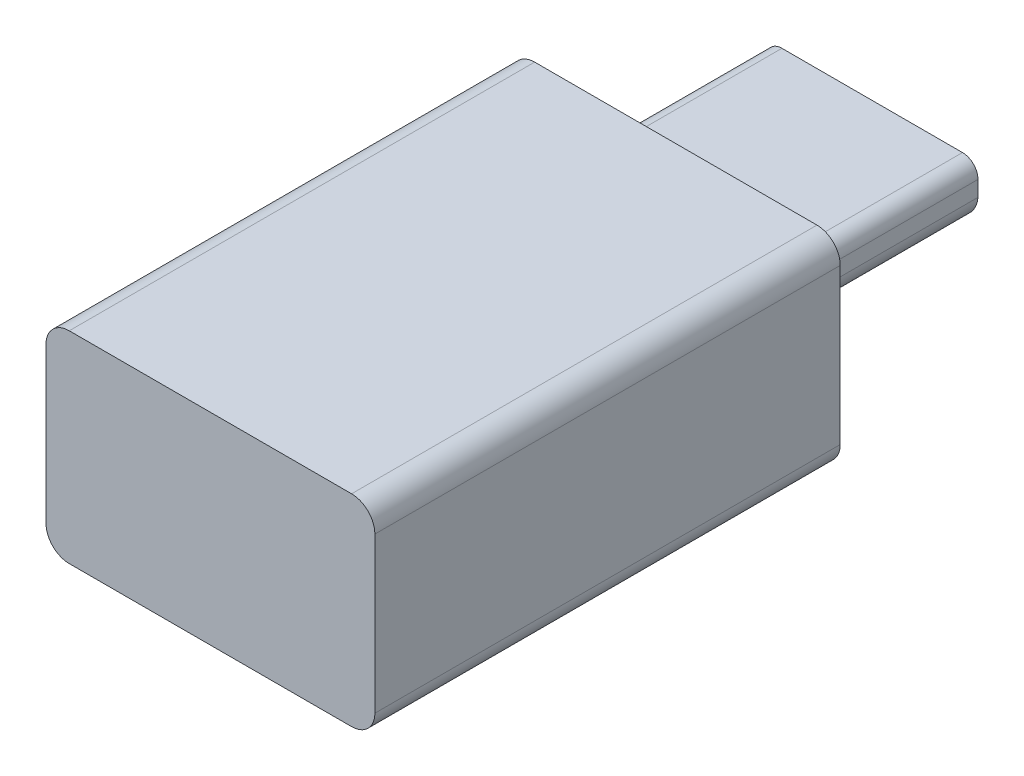
ISO-10303-21;
HEADER;
FILE_DESCRIPTION(('STEP AP214'),'2;1');
FILE_NAME('part.step','',(''),(''),'','','');
FILE_SCHEMA(('AUTOMOTIVE_DESIGN { 1 0 10303 214 1 1 1 1 }'));
ENDSEC;
DATA;
#1=APPLICATION_CONTEXT('core data for automotive mechanical design processes');
#2=APPLICATION_PROTOCOL_DEFINITION('international standard','automotive_design',2000,#1);
#3=PRODUCT_CONTEXT('',#1,'mechanical');
#4=PRODUCT('Part','Part','',(#3));
#5=PRODUCT_RELATED_PRODUCT_CATEGORY('part','',(#4));
#6=PRODUCT_DEFINITION_FORMATION('','',#4);
#7=PRODUCT_DEFINITION_CONTEXT('part definition',#1,'design');
#8=PRODUCT_DEFINITION('design','',#6,#7);
#9=PRODUCT_DEFINITION_SHAPE('','',#8);
#10=(LENGTH_UNIT() NAMED_UNIT(*) SI_UNIT(.MILLI.,.METRE.));
#11=(NAMED_UNIT(*) PLANE_ANGLE_UNIT() SI_UNIT($,.RADIAN.));
#12=(NAMED_UNIT(*) SI_UNIT($,.STERADIAN.) SOLID_ANGLE_UNIT());
#13=UNCERTAINTY_MEASURE_WITH_UNIT(LENGTH_MEASURE(1.E-05),#10,'distance_accuracy_value','');
#14=(GEOMETRIC_REPRESENTATION_CONTEXT(3) GLOBAL_UNCERTAINTY_ASSIGNED_CONTEXT((#13)) GLOBAL_UNIT_ASSIGNED_CONTEXT((#10,
#11,#12)) REPRESENTATION_CONTEXT('',''));
#15=CARTESIAN_POINT('',(0.,0.,0.));
#16=DIRECTION('',(0.,0.,1.));
#17=DIRECTION('',(1.,0.,0.));
#18=AXIS2_PLACEMENT_3D('',#15,#16,#17);
#19=CARTESIAN_POINT('',(-38.2706605434778,31.0905654389587,72.6019122643422));
#20=DIRECTION('',(0.,0.,1.));
#21=DIRECTION('',(1.,0.,0.));
#22=AXIS2_PLACEMENT_3D('',#19,#20,#21);
#23=CYLINDRICAL_SURFACE('',#22,0.750000000000001);
#24=CARTESIAN_POINT('',(-38.2706605434778,31.0905654389587,87.6019122643422));
#25=DIRECTION('',(0.,0.,-1.));
#26=DIRECTION('',(-1.,0.,0.));
#27=AXIS2_PLACEMENT_3D('',#24,#25,#26);
#28=CIRCLE('',#27,0.750000000000001);
#29=CARTESIAN_POINT('',(-37.5206605434778,31.0905654389587,87.6019122643422));
#30=VERTEX_POINT('',#29);
#31=CARTESIAN_POINT('',(-38.2706605434778,30.3405654389587,87.6019122643422));
#32=VERTEX_POINT('',#31);
#33=EDGE_CURVE('E142',#30,#32,#28,.T.);
#34=ORIENTED_EDGE('',*,*,#33,.T.);
#35=DIRECTION('',(0.,0.,1.));
#36=VECTOR('',#35,1.);
#37=CARTESIAN_POINT('',(-38.2706605434778,30.3405654389587,72.6019122643422));
#38=LINE('',#37,#36);
#39=CARTESIAN_POINT('',(-38.2706605434778,30.3405654389587,72.6019122643422));
#40=VERTEX_POINT('',#39);
#41=EDGE_CURVE('E11',#40,#32,#38,.T.);
#42=ORIENTED_EDGE('',*,*,#41,.F.);
#43=CARTESIAN_POINT('',(-38.2706605434778,31.0905654389587,72.6019122643422));
#44=DIRECTION('',(0.,0.,-1.));
#45=DIRECTION('',(-1.,0.,0.));
#46=AXIS2_PLACEMENT_3D('',#43,#44,#45);
#47=CIRCLE('',#46,0.750000000000001);
#48=CARTESIAN_POINT('',(-37.5206605434778,31.0905654389587,72.6019122643422));
#49=VERTEX_POINT('',#48);
#50=EDGE_CURVE('E158',#49,#40,#47,.T.);
#51=ORIENTED_EDGE('',*,*,#50,.F.);
#52=DIRECTION('',(0.,0.,1.));
#53=VECTOR('',#52,1.);
#54=CARTESIAN_POINT('',(-37.5206605434778,31.0905654389587,72.6019122643422));
#55=LINE('',#54,#53);
#56=EDGE_CURVE('E138',#49,#30,#55,.T.);
#57=ORIENTED_EDGE('',*,*,#56,.T.);
#58=EDGE_LOOP('',(#34,#42,#51,#57));
#59=FACE_BOUND('',#58,.T.);
#60=ADVANCED_FACE('F34',(#59),#23,.T.);
#61=CARTESIAN_POINT('',(-38.2706605434778,30.3405654389587,72.6019122643422));
#62=DIRECTION('',(0.,1.,0.));
#63=DIRECTION('',(0.,0.,1.));
#64=AXIS2_PLACEMENT_3D('',#61,#62,#63);
#65=PLANE('',#64);
#66=DIRECTION('',(-1.,0.,0.));
#67=VECTOR('',#66,1.);
#68=CARTESIAN_POINT('',(-38.2706605434778,30.3405654389587,87.6019122643422));
#69=LINE('',#68,#67);
#70=CARTESIAN_POINT('',(-47.3706605434778,30.3405654389587,87.6019122643422));
#71=VERTEX_POINT('',#70);
#72=EDGE_CURVE('E145',#32,#71,#69,.T.);
#73=ORIENTED_EDGE('',*,*,#72,.T.);
#74=DIRECTION('',(0.,0.,1.));
#75=VECTOR('',#74,1.);
#76=CARTESIAN_POINT('',(-47.3706605434778,30.3405654389587,72.6019122643422));
#77=LINE('',#76,#75);
#78=CARTESIAN_POINT('',(-47.3706605434778,30.3405654389587,72.6019122643422));
#79=VERTEX_POINT('',#78);
#80=EDGE_CURVE('E41',#79,#71,#77,.T.);
#81=ORIENTED_EDGE('',*,*,#80,.F.);
#82=DIRECTION('',(-1.,0.,0.));
#83=VECTOR('',#82,1.);
#84=CARTESIAN_POINT('',(-38.2706605434778,30.3405654389587,72.6019122643422));
#85=LINE('',#84,#83);
#86=EDGE_CURVE('E98',#40,#79,#85,.T.);
#87=ORIENTED_EDGE('',*,*,#86,.F.);
#88=ORIENTED_EDGE('',*,*,#41,.T.);
#89=EDGE_LOOP('',(#73,#81,#87,#88));
#90=FACE_BOUND('',#89,.T.);
#91=ADVANCED_FACE('F318',(#90),#65,.F.);
#92=CARTESIAN_POINT('',(-47.3706605434778,31.0905654389587,72.6019122643422));
#93=DIRECTION('',(0.,0.,1.));
#94=DIRECTION('',(1.,0.,0.));
#95=AXIS2_PLACEMENT_3D('',#92,#93,#94);
#96=CYLINDRICAL_SURFACE('',#95,0.750000000000001);
#97=CARTESIAN_POINT('',(-47.3706605434778,31.0905654389587,87.6019122643422));
#98=DIRECTION('',(0.,0.,-1.));
#99=DIRECTION('',(-1.,0.,0.));
#100=AXIS2_PLACEMENT_3D('',#97,#98,#99);
#101=CIRCLE('',#100,0.750000000000001);
#102=CARTESIAN_POINT('',(-48.1206605434778,31.0905654389587,87.6019122643422));
#103=VERTEX_POINT('',#102);
#104=EDGE_CURVE('E148',#71,#103,#101,.T.);
#105=ORIENTED_EDGE('',*,*,#104,.T.);
#106=DIRECTION('',(0.,0.,1.));
#107=VECTOR('',#106,1.);
#108=CARTESIAN_POINT('',(-48.1206605434778,31.0905654389587,72.6019122643422));
#109=LINE('',#108,#107);
#110=CARTESIAN_POINT('',(-48.1206605434778,31.0905654389587,72.6019122643422));
#111=VERTEX_POINT('',#110);
#112=EDGE_CURVE('E165',#111,#103,#109,.T.);
#113=ORIENTED_EDGE('',*,*,#112,.F.);
#114=CARTESIAN_POINT('',(-47.3706605434778,31.0905654389587,72.6019122643422));
#115=DIRECTION('',(0.,0.,-1.));
#116=DIRECTION('',(-1.,0.,0.));
#117=AXIS2_PLACEMENT_3D('',#114,#115,#116);
#118=CIRCLE('',#117,0.750000000000001);
#119=EDGE_CURVE('E173',#79,#111,#118,.T.);
#120=ORIENTED_EDGE('',*,*,#119,.F.);
#121=ORIENTED_EDGE('',*,*,#80,.T.);
#122=EDGE_LOOP('',(#105,#113,#120,#121));
#123=FACE_BOUND('',#122,.T.);
#124=ADVANCED_FACE('F171',(#123),#96,.T.);
#125=CARTESIAN_POINT('',(-48.1206605434778,36.0905654389587,72.6019122643422));
#126=DIRECTION('',(1.,0.,0.));
#127=DIRECTION('',(0.,0.,-1.));
#128=AXIS2_PLACEMENT_3D('',#125,#126,#127);
#129=PLANE('',#128);
#130=DIRECTION('',(0.,1.,0.));
#131=VECTOR('',#130,1.);
#132=CARTESIAN_POINT('',(-48.1206605434778,36.0905654389587,87.6019122643422));
#133=LINE('',#132,#131);
#134=CARTESIAN_POINT('',(-48.1206605434778,36.0905654389587,87.6019122643422));
#135=VERTEX_POINT('',#134);
#136=EDGE_CURVE('E150',#103,#135,#133,.T.);
#137=ORIENTED_EDGE('',*,*,#136,.T.);
#138=DIRECTION('',(0.,0.,1.));
#139=VECTOR('',#138,1.);
#140=CARTESIAN_POINT('',(-48.1206605434778,36.0905654389587,72.6019122643422));
#141=LINE('',#140,#139);
#142=CARTESIAN_POINT('',(-48.1206605434778,36.0905654389587,72.6019122643422));
#143=VERTEX_POINT('',#142);
#144=EDGE_CURVE('E162',#143,#135,#141,.T.);
#145=ORIENTED_EDGE('',*,*,#144,.F.);
#146=DIRECTION('',(0.,1.,0.));
#147=VECTOR('',#146,1.);
#148=CARTESIAN_POINT('',(-48.1206605434778,36.0905654389587,72.6019122643422));
#149=LINE('',#148,#147);
#150=EDGE_CURVE('E185',#111,#143,#149,.T.);
#151=ORIENTED_EDGE('',*,*,#150,.F.);
#152=ORIENTED_EDGE('',*,*,#112,.T.);
#153=EDGE_LOOP('',(#137,#145,#151,#152));
#154=FACE_BOUND('',#153,.T.);
#155=ADVANCED_FACE('F181',(#154),#129,.F.);
#156=CARTESIAN_POINT('',(-47.3706605434778,36.0905654389587,72.6019122643422));
#157=DIRECTION('',(0.,0.,1.));
#158=DIRECTION('',(1.,0.,0.));
#159=AXIS2_PLACEMENT_3D('',#156,#157,#158);
#160=CYLINDRICAL_SURFACE('',#159,0.750000000000001);
#161=CARTESIAN_POINT('',(-47.3706605434778,36.0905654389587,87.6019122643422));
#162=DIRECTION('',(0.,0.,-1.));
#163=DIRECTION('',(1.,0.,0.));
#164=AXIS2_PLACEMENT_3D('',#161,#162,#163);
#165=CIRCLE('',#164,0.750000000000001);
#166=CARTESIAN_POINT('',(-47.3706605434778,36.8405654389587,87.6019122643422));
#167=VERTEX_POINT('',#166);
#168=EDGE_CURVE('E152',#135,#167,#165,.T.);
#169=ORIENTED_EDGE('',*,*,#168,.T.);
#170=DIRECTION('',(0.,0.,1.));
#171=VECTOR('',#170,1.);
#172=CARTESIAN_POINT('',(-47.3706605434778,36.8405654389587,72.6019122643422));
#173=LINE('',#172,#171);
#174=CARTESIAN_POINT('',(-47.3706605434778,36.8405654389587,72.6019122643422));
#175=VERTEX_POINT('',#174);
#176=EDGE_CURVE('E133',#175,#167,#173,.T.);
#177=ORIENTED_EDGE('',*,*,#176,.F.);
#178=CARTESIAN_POINT('',(-47.3706605434778,36.0905654389587,72.6019122643422));
#179=DIRECTION('',(0.,0.,-1.));
#180=DIRECTION('',(1.,0.,0.));
#181=AXIS2_PLACEMENT_3D('',#178,#179,#180);
#182=CIRCLE('',#181,0.750000000000001);
#183=EDGE_CURVE('E121',#143,#175,#182,.T.);
#184=ORIENTED_EDGE('',*,*,#183,.F.);
#185=ORIENTED_EDGE('',*,*,#144,.T.);
#186=EDGE_LOOP('',(#169,#177,#184,#185));
#187=FACE_BOUND('',#186,.T.);
#188=ADVANCED_FACE('F184',(#187),#160,.T.);
#189=CARTESIAN_POINT('',(-38.2706605434778,36.8405654389587,72.6019122643422));
#190=DIRECTION('',(0.,-1.,0.));
#191=DIRECTION('',(0.,0.,-1.));
#192=AXIS2_PLACEMENT_3D('',#189,#190,#191);
#193=PLANE('',#192);
#194=DIRECTION('',(1.,0.,0.));
#195=VECTOR('',#194,1.);
#196=CARTESIAN_POINT('',(-38.2706605434778,36.8405654389587,87.6019122643422));
#197=LINE('',#196,#195);
#198=CARTESIAN_POINT('',(-38.2706605434778,36.8405654389587,87.6019122643422));
#199=VERTEX_POINT('',#198);
#200=EDGE_CURVE('E130',#167,#199,#197,.T.);
#201=ORIENTED_EDGE('',*,*,#200,.T.);
#202=DIRECTION('',(0.,0.,1.));
#203=VECTOR('',#202,1.);
#204=CARTESIAN_POINT('',(-38.2706605434778,36.8405654389587,72.6019122643422));
#205=LINE('',#204,#203);
#206=CARTESIAN_POINT('',(-38.2706605434778,36.8405654389587,72.6019122643422));
#207=VERTEX_POINT('',#206);
#208=EDGE_CURVE('E127',#207,#199,#205,.T.);
#209=ORIENTED_EDGE('',*,*,#208,.F.);
#210=DIRECTION('',(1.,0.,0.));
#211=VECTOR('',#210,1.);
#212=CARTESIAN_POINT('',(-38.2706605434778,36.8405654389587,72.6019122643422));
#213=LINE('',#212,#211);
#214=EDGE_CURVE('E114',#175,#207,#213,.T.);
#215=ORIENTED_EDGE('',*,*,#214,.F.);
#216=ORIENTED_EDGE('',*,*,#176,.T.);
#217=EDGE_LOOP('',(#201,#209,#215,#216));
#218=FACE_BOUND('',#217,.T.);
#219=ADVANCED_FACE('F128',(#218),#193,.F.);
#220=CARTESIAN_POINT('',(-38.2706605434778,36.0905654389587,72.6019122643422));
#221=DIRECTION('',(0.,0.,1.));
#222=DIRECTION('',(1.,0.,0.));
#223=AXIS2_PLACEMENT_3D('',#220,#221,#222);
#224=CYLINDRICAL_SURFACE('',#223,0.750000000000001);
#225=CARTESIAN_POINT('',(-38.2706605434778,36.0905654389587,87.6019122643422));
#226=DIRECTION('',(0.,0.,-1.));
#227=DIRECTION('',(-1.,0.,0.));
#228=AXIS2_PLACEMENT_3D('',#225,#226,#227);
#229=CIRCLE('',#228,0.750000000000001);
#230=CARTESIAN_POINT('',(-37.5206605434778,36.0905654389587,87.6019122643422));
#231=VERTEX_POINT('',#230);
#232=EDGE_CURVE('E155',#199,#231,#229,.T.);
#233=ORIENTED_EDGE('',*,*,#232,.T.);
#234=DIRECTION('',(0.,0.,1.));
#235=VECTOR('',#234,1.);
#236=CARTESIAN_POINT('',(-37.5206605434778,36.0905654389587,72.6019122643422));
#237=LINE('',#236,#235);
#238=CARTESIAN_POINT('',(-37.5206605434778,36.0905654389587,72.6019122643422));
#239=VERTEX_POINT('',#238);
#240=EDGE_CURVE('E134',#239,#231,#237,.T.);
#241=ORIENTED_EDGE('',*,*,#240,.F.);
#242=CARTESIAN_POINT('',(-38.2706605434778,36.0905654389587,72.6019122643422));
#243=DIRECTION('',(0.,0.,-1.));
#244=DIRECTION('',(-1.,0.,0.));
#245=AXIS2_PLACEMENT_3D('',#242,#243,#244);
#246=CIRCLE('',#245,0.750000000000001);
#247=EDGE_CURVE('E118',#207,#239,#246,.T.);
#248=ORIENTED_EDGE('',*,*,#247,.F.);
#249=ORIENTED_EDGE('',*,*,#208,.T.);
#250=EDGE_LOOP('',(#233,#241,#248,#249));
#251=FACE_BOUND('',#250,.T.);
#252=ADVANCED_FACE('F136',(#251),#224,.T.);
#253=CARTESIAN_POINT('',(-37.5206605434778,36.0905654389587,72.6019122643422));
#254=DIRECTION('',(-1.,0.,0.));
#255=DIRECTION('',(0.,0.,1.));
#256=AXIS2_PLACEMENT_3D('',#253,#254,#255);
#257=PLANE('',#256);
#258=DIRECTION('',(0.,-1.,0.));
#259=VECTOR('',#258,1.);
#260=CARTESIAN_POINT('',(-37.5206605434778,36.0905654389587,87.6019122643422));
#261=LINE('',#260,#259);
#262=EDGE_CURVE('E90',#231,#30,#261,.T.);
#263=ORIENTED_EDGE('',*,*,#262,.T.);
#264=ORIENTED_EDGE('',*,*,#56,.F.);
#265=DIRECTION('',(0.,-1.,0.));
#266=VECTOR('',#265,1.);
#267=CARTESIAN_POINT('',(-37.5206605434778,36.0905654389587,72.6019122643422));
#268=LINE('',#267,#266);
#269=EDGE_CURVE('E57',#239,#49,#268,.T.);
#270=ORIENTED_EDGE('',*,*,#269,.F.);
#271=ORIENTED_EDGE('',*,*,#240,.T.);
#272=EDGE_LOOP('',(#263,#264,#270,#271));
#273=FACE_BOUND('',#272,.T.);
#274=ADVANCED_FACE('F325',(#273),#257,.F.);
#275=CARTESIAN_POINT('',(-38.2706605434778,31.0905654389587,72.6019122643422));
#276=DIRECTION('',(0.,0.,-1.));
#277=DIRECTION('',(-1.,0.,0.));
#278=AXIS2_PLACEMENT_3D('',#275,#276,#277);
#279=PLANE('',#278);
#280=CARTESIAN_POINT('',(-40.3206605434778,33.9644208606455,72.6019122643422));
#281=DIRECTION('',(0.,0.,-1.));
#282=DIRECTION('',(-1.,0.,0.));
#283=AXIS2_PLACEMENT_3D('',#280,#281,#282);
#284=CIRCLE('',#283,0.91385542168674);
#285=CARTESIAN_POINT('',(-40.3206605434778,33.0505654389587,72.6019122643422));
#286=VERTEX_POINT('',#285);
#287=CARTESIAN_POINT('',(-39.4106605434778,33.8805654389587,72.6019122643422));
#288=VERTEX_POINT('',#287);
#289=EDGE_CURVE('E233',#286,#288,#284,.F.);
#290=ORIENTED_EDGE('',*,*,#289,.T.);
#291=DIRECTION('',(0.,-1.,0.));
#292=VECTOR('',#291,1.);
#293=CARTESIAN_POINT('',(-39.4106605434778,0.,72.6019122643422));
#294=LINE('',#293,#292);
#295=CARTESIAN_POINT('',(-39.4106605434778,34.3805654389587,72.6019122643422));
#296=VERTEX_POINT('',#295);
#297=EDGE_CURVE('E213',#296,#288,#294,.T.);
#298=ORIENTED_EDGE('',*,*,#297,.F.);
#299=CARTESIAN_POINT('',(-39.9106605434778,34.3805654389587,72.6019122643422));
#300=DIRECTION('',(0.,0.,-1.));
#301=DIRECTION('',(-1.,0.,0.));
#302=AXIS2_PLACEMENT_3D('',#299,#300,#301);
#303=CIRCLE('',#302,0.5);
#304=CARTESIAN_POINT('',(-39.9106605434778,34.8805654389587,72.6019122643422));
#305=VERTEX_POINT('',#304);
#306=EDGE_CURVE('E216',#305,#296,#303,.T.);
#307=ORIENTED_EDGE('',*,*,#306,.F.);
#308=DIRECTION('',(-1.,0.,0.));
#309=VECTOR('',#308,1.);
#310=CARTESIAN_POINT('',(0.,34.8805654389587,72.6019122643422));
#311=LINE('',#310,#309);
#312=CARTESIAN_POINT('',(-45.7306605434778,34.8805654389587,72.6019122643422));
#313=VERTEX_POINT('',#312);
#314=EDGE_CURVE('E218',#305,#313,#311,.T.);
#315=ORIENTED_EDGE('',*,*,#314,.T.);
#316=CARTESIAN_POINT('',(-45.7306605434778,34.3805654389587,72.6019122643422));
#317=DIRECTION('',(0.,0.,-1.));
#318=DIRECTION('',(-1.,0.,0.));
#319=AXIS2_PLACEMENT_3D('',#316,#317,#318);
#320=CIRCLE('',#319,0.5);
#321=CARTESIAN_POINT('',(-46.2306605434778,34.3805654389587,72.6019122643422));
#322=VERTEX_POINT('',#321);
#323=EDGE_CURVE('E221',#313,#322,#320,.F.);
#324=ORIENTED_EDGE('',*,*,#323,.T.);
#325=DIRECTION('',(0.,-1.,0.));
#326=VECTOR('',#325,1.);
#327=CARTESIAN_POINT('',(-46.2306605434778,0.,72.6019122643422));
#328=LINE('',#327,#326);
#329=CARTESIAN_POINT('',(-46.2306605434778,33.8805654389587,72.6019122643422));
#330=VERTEX_POINT('',#329);
#331=EDGE_CURVE('E224',#322,#330,#328,.T.);
#332=ORIENTED_EDGE('',*,*,#331,.T.);
#333=CARTESIAN_POINT('',(-45.3206605434778,33.9644208606455,72.6019122643422));
#334=DIRECTION('',(0.,0.,-1.));
#335=DIRECTION('',(-1.,0.,0.));
#336=AXIS2_PLACEMENT_3D('',#333,#334,#335);
#337=CIRCLE('',#336,0.91385542168674);
#338=CARTESIAN_POINT('',(-45.3206605434778,33.0505654389587,72.6019122643422));
#339=VERTEX_POINT('',#338);
#340=EDGE_CURVE('E227',#339,#330,#337,.T.);
#341=ORIENTED_EDGE('',*,*,#340,.F.);
#342=DIRECTION('',(-1.,0.,0.));
#343=VECTOR('',#342,1.);
#344=CARTESIAN_POINT('',(0.,33.0505654389587,72.6019122643422));
#345=LINE('',#344,#343);
#346=EDGE_CURVE('E230',#286,#339,#345,.T.);
#347=ORIENTED_EDGE('',*,*,#346,.F.);
#348=EDGE_LOOP('',(#290,#298,#307,#315,#324,#332,#341,#347));
#349=FACE_BOUND('',#348,.T.);
#350=ORIENTED_EDGE('',*,*,#50,.T.);
#351=ORIENTED_EDGE('',*,*,#86,.T.);
#352=ORIENTED_EDGE('',*,*,#119,.T.);
#353=ORIENTED_EDGE('',*,*,#150,.T.);
#354=ORIENTED_EDGE('',*,*,#183,.T.);
#355=ORIENTED_EDGE('',*,*,#214,.T.);
#356=ORIENTED_EDGE('',*,*,#247,.T.);
#357=ORIENTED_EDGE('',*,*,#269,.T.);
#358=EDGE_LOOP('',(#350,#351,#352,#353,#354,#355,#356,#357));
#359=FACE_BOUND('',#358,.T.);
#360=ADVANCED_FACE('F116',(#349,#359),#279,.T.);
#361=CARTESIAN_POINT('',(-38.2706605434778,31.0905654389587,87.6019122643422));
#362=DIRECTION('',(0.,0.,-1.));
#363=DIRECTION('',(-1.,0.,0.));
#364=AXIS2_PLACEMENT_3D('',#361,#362,#363);
#365=PLANE('',#364);
#366=ORIENTED_EDGE('',*,*,#33,.F.);
#367=ORIENTED_EDGE('',*,*,#262,.F.);
#368=ORIENTED_EDGE('',*,*,#232,.F.);
#369=ORIENTED_EDGE('',*,*,#200,.F.);
#370=ORIENTED_EDGE('',*,*,#168,.F.);
#371=ORIENTED_EDGE('',*,*,#136,.F.);
#372=ORIENTED_EDGE('',*,*,#104,.F.);
#373=ORIENTED_EDGE('',*,*,#72,.F.);
#374=EDGE_LOOP('',(#366,#367,#368,#369,#370,#371,#372,#373));
#375=FACE_BOUND('',#374,.T.);
#376=ADVANCED_FACE('F177',(#375),#365,.F.);
#377=CARTESIAN_POINT('',(-40.3206605434778,33.9644208606455,66.2719122643422));
#378=DIRECTION('',(0.,0.,1.));
#379=DIRECTION('',(1.,0.,0.));
#380=AXIS2_PLACEMENT_3D('',#377,#378,#379);
#381=CYLINDRICAL_SURFACE('',#380,0.91385542168674);
#382=ORIENTED_EDGE('',*,*,#289,.F.);
#383=DIRECTION('',(0.,0.,1.));
#384=VECTOR('',#383,1.);
#385=CARTESIAN_POINT('',(-40.3206605434778,33.0505654389587,66.2719122643422));
#386=LINE('',#385,#384);
#387=CARTESIAN_POINT('',(-40.3206605434778,33.0505654389587,66.2719122643422));
#388=VERTEX_POINT('',#387);
#389=EDGE_CURVE('E146',#388,#286,#386,.T.);
#390=ORIENTED_EDGE('',*,*,#389,.F.);
#391=CARTESIAN_POINT('',(-40.3206605434778,33.9644208606455,66.2719122643422));
#392=DIRECTION('',(0.,0.,-1.));
#393=DIRECTION('',(-1.,0.,0.));
#394=AXIS2_PLACEMENT_3D('',#391,#392,#393);
#395=CIRCLE('',#394,0.91385542168674);
#396=CARTESIAN_POINT('',(-39.4106605434778,33.8805654389587,66.2719122643422));
#397=VERTEX_POINT('',#396);
#398=EDGE_CURVE('E215',#388,#397,#395,.F.);
#399=ORIENTED_EDGE('',*,*,#398,.T.);
#400=DIRECTION('',(0.,0.,1.));
#401=VECTOR('',#400,1.);
#402=CARTESIAN_POINT('',(-39.4106605434778,33.8805654389587,66.2719122643422));
#403=LINE('',#402,#401);
#404=EDGE_CURVE('E209',#397,#288,#403,.T.);
#405=ORIENTED_EDGE('',*,*,#404,.T.);
#406=EDGE_LOOP('',(#382,#390,#399,#405));
#407=FACE_BOUND('',#406,.T.);
#408=ADVANCED_FACE('F261',(#407),#381,.T.);
#409=CARTESIAN_POINT('',(0.,33.0505654389587,66.2719122643422));
#410=DIRECTION('',(0.,1.,0.));
#411=DIRECTION('',(0.,0.,1.));
#412=AXIS2_PLACEMENT_3D('',#409,#410,#411);
#413=PLANE('',#412);
#414=ORIENTED_EDGE('',*,*,#346,.T.);
#415=DIRECTION('',(0.,0.,1.));
#416=VECTOR('',#415,1.);
#417=CARTESIAN_POINT('',(-45.3206605434778,33.0505654389587,66.2719122643422));
#418=LINE('',#417,#416);
#419=CARTESIAN_POINT('',(-45.3206605434778,33.0505654389587,66.2719122643422));
#420=VERTEX_POINT('',#419);
#421=EDGE_CURVE('E193',#420,#339,#418,.T.);
#422=ORIENTED_EDGE('',*,*,#421,.F.);
#423=DIRECTION('',(-1.,0.,0.));
#424=VECTOR('',#423,1.);
#425=CARTESIAN_POINT('',(0.,33.0505654389587,66.2719122643422));
#426=LINE('',#425,#424);
#427=EDGE_CURVE('E253',#388,#420,#426,.T.);
#428=ORIENTED_EDGE('',*,*,#427,.F.);
#429=ORIENTED_EDGE('',*,*,#389,.T.);
#430=EDGE_LOOP('',(#414,#422,#428,#429));
#431=FACE_BOUND('',#430,.T.);
#432=ADVANCED_FACE('F389',(#431),#413,.F.);
#433=CARTESIAN_POINT('',(-45.3206605434778,33.9644208606455,66.2719122643422));
#434=DIRECTION('',(0.,0.,1.));
#435=DIRECTION('',(1.,0.,0.));
#436=AXIS2_PLACEMENT_3D('',#433,#434,#435);
#437=CYLINDRICAL_SURFACE('',#436,0.91385542168674);
#438=ORIENTED_EDGE('',*,*,#340,.T.);
#439=DIRECTION('',(0.,0.,1.));
#440=VECTOR('',#439,1.);
#441=CARTESIAN_POINT('',(-46.2306605434778,33.8805654389587,66.2719122643422));
#442=LINE('',#441,#440);
#443=CARTESIAN_POINT('',(-46.2306605434778,33.8805654389587,66.2719122643422));
#444=VERTEX_POINT('',#443);
#445=EDGE_CURVE('E196',#444,#330,#442,.T.);
#446=ORIENTED_EDGE('',*,*,#445,.F.);
#447=CARTESIAN_POINT('',(-45.3206605434778,33.9644208606455,66.2719122643422));
#448=DIRECTION('',(0.,0.,-1.));
#449=DIRECTION('',(-1.,0.,0.));
#450=AXIS2_PLACEMENT_3D('',#447,#448,#449);
#451=CIRCLE('',#450,0.91385542168674);
#452=EDGE_CURVE('E250',#420,#444,#451,.T.);
#453=ORIENTED_EDGE('',*,*,#452,.F.);
#454=ORIENTED_EDGE('',*,*,#421,.T.);
#455=EDGE_LOOP('',(#438,#446,#453,#454));
#456=FACE_BOUND('',#455,.T.);
#457=ADVANCED_FACE('F399',(#456),#437,.T.);
#458=CARTESIAN_POINT('',(-46.2306605434778,0.,66.2719122643422));
#459=DIRECTION('',(-1.,0.,0.));
#460=DIRECTION('',(0.,0.,1.));
#461=AXIS2_PLACEMENT_3D('',#458,#459,#460);
#462=PLANE('',#461);
#463=ORIENTED_EDGE('',*,*,#331,.F.);
#464=DIRECTION('',(0.,0.,1.));
#465=VECTOR('',#464,1.);
#466=CARTESIAN_POINT('',(-46.2306605434778,34.3805654389587,66.2719122643422));
#467=LINE('',#466,#465);
#468=CARTESIAN_POINT('',(-46.2306605434778,34.3805654389587,66.2719122643422));
#469=VERTEX_POINT('',#468);
#470=EDGE_CURVE('E199',#469,#322,#467,.T.);
#471=ORIENTED_EDGE('',*,*,#470,.F.);
#472=DIRECTION('',(0.,-1.,0.));
#473=VECTOR('',#472,1.);
#474=CARTESIAN_POINT('',(-46.2306605434778,0.,66.2719122643422));
#475=LINE('',#474,#473);
#476=EDGE_CURVE('E247',#469,#444,#475,.T.);
#477=ORIENTED_EDGE('',*,*,#476,.T.);
#478=ORIENTED_EDGE('',*,*,#445,.T.);
#479=EDGE_LOOP('',(#463,#471,#477,#478));
#480=FACE_BOUND('',#479,.T.);
#481=ADVANCED_FACE('F409',(#480),#462,.T.);
#482=CARTESIAN_POINT('',(-45.7306605434778,34.3805654389587,66.2719122643422));
#483=DIRECTION('',(0.,0.,1.));
#484=DIRECTION('',(1.,0.,0.));
#485=AXIS2_PLACEMENT_3D('',#482,#483,#484);
#486=CYLINDRICAL_SURFACE('',#485,0.5);
#487=ORIENTED_EDGE('',*,*,#323,.F.);
#488=DIRECTION('',(0.,0.,1.));
#489=VECTOR('',#488,1.);
#490=CARTESIAN_POINT('',(-45.7306605434778,34.8805654389587,66.2719122643422));
#491=LINE('',#490,#489);
#492=CARTESIAN_POINT('',(-45.7306605434778,34.8805654389587,66.2719122643422));
#493=VERTEX_POINT('',#492);
#494=EDGE_CURVE('E202',#493,#313,#491,.T.);
#495=ORIENTED_EDGE('',*,*,#494,.F.);
#496=CARTESIAN_POINT('',(-45.7306605434778,34.3805654389587,66.2719122643422));
#497=DIRECTION('',(0.,0.,-1.));
#498=DIRECTION('',(-1.,0.,0.));
#499=AXIS2_PLACEMENT_3D('',#496,#497,#498);
#500=CIRCLE('',#499,0.5);
#501=EDGE_CURVE('E244',#493,#469,#500,.F.);
#502=ORIENTED_EDGE('',*,*,#501,.T.);
#503=ORIENTED_EDGE('',*,*,#470,.T.);
#504=EDGE_LOOP('',(#487,#495,#502,#503));
#505=FACE_BOUND('',#504,.T.);
#506=ADVANCED_FACE('F419',(#505),#486,.T.);
#507=CARTESIAN_POINT('',(0.,34.8805654389587,66.2719122643422));
#508=DIRECTION('',(0.,1.,0.));
#509=DIRECTION('',(0.,0.,1.));
#510=AXIS2_PLACEMENT_3D('',#507,#508,#509);
#511=PLANE('',#510);
#512=ORIENTED_EDGE('',*,*,#314,.F.);
#513=DIRECTION('',(0.,0.,1.));
#514=VECTOR('',#513,1.);
#515=CARTESIAN_POINT('',(-39.9106605434778,34.8805654389587,66.2719122643422));
#516=LINE('',#515,#514);
#517=CARTESIAN_POINT('',(-39.9106605434778,34.8805654389587,66.2719122643422));
#518=VERTEX_POINT('',#517);
#519=EDGE_CURVE('E205',#518,#305,#516,.T.);
#520=ORIENTED_EDGE('',*,*,#519,.F.);
#521=DIRECTION('',(-1.,0.,0.));
#522=VECTOR('',#521,1.);
#523=CARTESIAN_POINT('',(0.,34.8805654389587,66.2719122643422));
#524=LINE('',#523,#522);
#525=EDGE_CURVE('E241',#518,#493,#524,.T.);
#526=ORIENTED_EDGE('',*,*,#525,.T.);
#527=ORIENTED_EDGE('',*,*,#494,.T.);
#528=EDGE_LOOP('',(#512,#520,#526,#527));
#529=FACE_BOUND('',#528,.T.);
#530=ADVANCED_FACE('F304',(#529),#511,.T.);
#531=CARTESIAN_POINT('',(-39.9106605434778,34.3805654389587,66.2719122643422));
#532=DIRECTION('',(0.,0.,1.));
#533=DIRECTION('',(1.,0.,0.));
#534=AXIS2_PLACEMENT_3D('',#531,#532,#533);
#535=CYLINDRICAL_SURFACE('',#534,0.5);
#536=ORIENTED_EDGE('',*,*,#306,.T.);
#537=DIRECTION('',(0.,0.,1.));
#538=VECTOR('',#537,1.);
#539=CARTESIAN_POINT('',(-39.4106605434778,34.3805654389587,66.2719122643422));
#540=LINE('',#539,#538);
#541=CARTESIAN_POINT('',(-39.4106605434778,34.3805654389587,66.2719122643422));
#542=VERTEX_POINT('',#541);
#543=EDGE_CURVE('E48',#542,#296,#540,.T.);
#544=ORIENTED_EDGE('',*,*,#543,.F.);
#545=CARTESIAN_POINT('',(-39.9106605434778,34.3805654389587,66.2719122643422));
#546=DIRECTION('',(0.,0.,-1.));
#547=DIRECTION('',(-1.,0.,0.));
#548=AXIS2_PLACEMENT_3D('',#545,#546,#547);
#549=CIRCLE('',#548,0.5);
#550=EDGE_CURVE('E238',#518,#542,#549,.T.);
#551=ORIENTED_EDGE('',*,*,#550,.F.);
#552=ORIENTED_EDGE('',*,*,#519,.T.);
#553=EDGE_LOOP('',(#536,#544,#551,#552));
#554=FACE_BOUND('',#553,.T.);
#555=ADVANCED_FACE('F299',(#554),#535,.T.);
#556=CARTESIAN_POINT('',(-39.4106605434778,0.,66.2719122643422));
#557=DIRECTION('',(-1.,0.,0.));
#558=DIRECTION('',(0.,0.,1.));
#559=AXIS2_PLACEMENT_3D('',#556,#557,#558);
#560=PLANE('',#559);
#561=ORIENTED_EDGE('',*,*,#297,.T.);
#562=ORIENTED_EDGE('',*,*,#404,.F.);
#563=DIRECTION('',(0.,-1.,0.));
#564=VECTOR('',#563,1.);
#565=CARTESIAN_POINT('',(-39.4106605434778,0.,66.2719122643422));
#566=LINE('',#565,#564);
#567=EDGE_CURVE('E212',#542,#397,#566,.T.);
#568=ORIENTED_EDGE('',*,*,#567,.F.);
#569=ORIENTED_EDGE('',*,*,#543,.T.);
#570=EDGE_LOOP('',(#561,#562,#568,#569));
#571=FACE_BOUND('',#570,.T.);
#572=ADVANCED_FACE('F308',(#571),#560,.F.);
#573=CARTESIAN_POINT('',(0.,0.,66.2719122643422));
#574=DIRECTION('',(0.,0.,-1.));
#575=DIRECTION('',(-1.,0.,0.));
#576=AXIS2_PLACEMENT_3D('',#573,#574,#575);
#577=PLANE('',#576);
#578=ORIENTED_EDGE('',*,*,#398,.F.);
#579=ORIENTED_EDGE('',*,*,#427,.T.);
#580=ORIENTED_EDGE('',*,*,#452,.T.);
#581=ORIENTED_EDGE('',*,*,#476,.F.);
#582=ORIENTED_EDGE('',*,*,#501,.F.);
#583=ORIENTED_EDGE('',*,*,#525,.F.);
#584=ORIENTED_EDGE('',*,*,#550,.T.);
#585=ORIENTED_EDGE('',*,*,#567,.T.);
#586=EDGE_LOOP('',(#578,#579,#580,#581,#582,#583,#584,#585));
#587=FACE_BOUND('',#586,.T.);
#588=ADVANCED_FACE('F268',(#587),#577,.T.);
#589=CLOSED_SHELL('',(#60,#91,#124,#155,#188,#219,#252,#274,#360,#376,#408,#432,#457,#481,#506,
#530,#555,#572,#588));
#590=MANIFOLD_SOLID_BREP('B2',#589);
#591=ADVANCED_BREP_SHAPE_REPRESENTATION('',(#18,#590),#14);
#592=SHAPE_DEFINITION_REPRESENTATION(#9,#591);
ENDSEC;
END-ISO-10303-21;
